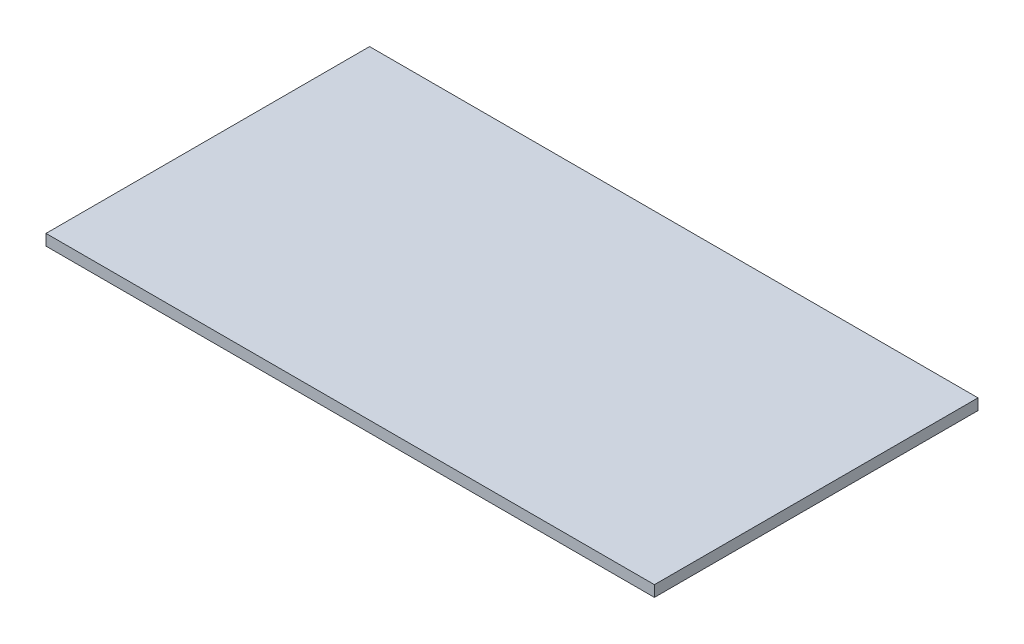
ISO-10303-21;
HEADER;
FILE_DESCRIPTION(('STEP AP214'),'2;1');
FILE_NAME('part.step','',(''),(''),'','','');
FILE_SCHEMA(('AUTOMOTIVE_DESIGN { 1 0 10303 214 1 1 1 1 }'));
ENDSEC;
DATA;
#1=APPLICATION_CONTEXT('core data for automotive mechanical design processes');
#2=APPLICATION_PROTOCOL_DEFINITION('international standard','automotive_design',2000,#1);
#3=PRODUCT_CONTEXT('',#1,'mechanical');
#4=PRODUCT('Part','Part','',(#3));
#5=PRODUCT_RELATED_PRODUCT_CATEGORY('part','',(#4));
#6=PRODUCT_DEFINITION_FORMATION('','',#4);
#7=PRODUCT_DEFINITION_CONTEXT('part definition',#1,'design');
#8=PRODUCT_DEFINITION('design','',#6,#7);
#9=PRODUCT_DEFINITION_SHAPE('','',#8);
#10=(LENGTH_UNIT() NAMED_UNIT(*) SI_UNIT(.MILLI.,.METRE.));
#11=(NAMED_UNIT(*) PLANE_ANGLE_UNIT() SI_UNIT($,.RADIAN.));
#12=(NAMED_UNIT(*) SI_UNIT($,.STERADIAN.) SOLID_ANGLE_UNIT());
#13=UNCERTAINTY_MEASURE_WITH_UNIT(LENGTH_MEASURE(1.E-05),#10,'distance_accuracy_value','');
#14=(GEOMETRIC_REPRESENTATION_CONTEXT(3) GLOBAL_UNCERTAINTY_ASSIGNED_CONTEXT((#13)) GLOBAL_UNIT_ASSIGNED_CONTEXT((#10,
#11,#12)) REPRESENTATION_CONTEXT('',''));
#15=CARTESIAN_POINT('',(0.,0.,0.));
#16=DIRECTION('',(0.,0.,1.));
#17=DIRECTION('',(1.,0.,0.));
#18=AXIS2_PLACEMENT_3D('',#15,#16,#17);
#19=CARTESIAN_POINT('',(110.,4.,58.5));
#20=DIRECTION('',(-1.,0.,0.));
#21=DIRECTION('',(0.,0.,1.));
#22=AXIS2_PLACEMENT_3D('',#19,#20,#21);
#23=PLANE('',#22);
#24=DIRECTION('',(0.,0.,-1.));
#25=VECTOR('',#24,1.);
#26=CARTESIAN_POINT('',(110.,0.,58.5));
#27=LINE('',#26,#25);
#28=CARTESIAN_POINT('',(110.,0.,58.5));
#29=VERTEX_POINT('',#28);
#30=CARTESIAN_POINT('',(110.,0.,-58.5));
#31=VERTEX_POINT('',#30);
#32=EDGE_CURVE('E112',#29,#31,#27,.T.);
#33=ORIENTED_EDGE('',*,*,#32,.T.);
#34=DIRECTION('',(0.,-1.,0.));
#35=VECTOR('',#34,1.);
#36=CARTESIAN_POINT('',(110.,4.,-58.5));
#37=LINE('',#36,#35);
#38=CARTESIAN_POINT('',(110.,4.,-58.5));
#39=VERTEX_POINT('',#38);
#40=EDGE_CURVE('E11',#39,#31,#37,.T.);
#41=ORIENTED_EDGE('',*,*,#40,.F.);
#42=DIRECTION('',(0.,0.,-1.));
#43=VECTOR('',#42,1.);
#44=CARTESIAN_POINT('',(110.,4.,58.5));
#45=LINE('',#44,#43);
#46=CARTESIAN_POINT('',(110.,4.,58.5));
#47=VERTEX_POINT('',#46);
#48=EDGE_CURVE('E96',#47,#39,#45,.T.);
#49=ORIENTED_EDGE('',*,*,#48,.F.);
#50=DIRECTION('',(0.,-1.,0.));
#51=VECTOR('',#50,1.);
#52=CARTESIAN_POINT('',(110.,4.,58.5));
#53=LINE('',#52,#51);
#54=EDGE_CURVE('E108',#47,#29,#53,.T.);
#55=ORIENTED_EDGE('',*,*,#54,.T.);
#56=EDGE_LOOP('',(#33,#41,#49,#55));
#57=FACE_BOUND('',#56,.T.);
#58=ADVANCED_FACE('F44',(#57),#23,.F.);
#59=CARTESIAN_POINT('',(-110.,4.,-58.5));
#60=DIRECTION('',(0.,0.,1.));
#61=DIRECTION('',(1.,0.,0.));
#62=AXIS2_PLACEMENT_3D('',#59,#60,#61);
#63=PLANE('',#62);
#64=DIRECTION('',(-1.,0.,0.));
#65=VECTOR('',#64,1.);
#66=CARTESIAN_POINT('',(-110.,0.,-58.5));
#67=LINE('',#66,#65);
#68=CARTESIAN_POINT('',(-110.,0.,-58.5));
#69=VERTEX_POINT('',#68);
#70=EDGE_CURVE('E101',#31,#69,#67,.T.);
#71=ORIENTED_EDGE('',*,*,#70,.T.);
#72=DIRECTION('',(0.,-1.,0.));
#73=VECTOR('',#72,1.);
#74=CARTESIAN_POINT('',(-110.,4.,-58.5));
#75=LINE('',#74,#73);
#76=CARTESIAN_POINT('',(-110.,4.,-58.5));
#77=VERTEX_POINT('',#76);
#78=EDGE_CURVE('E53',#77,#69,#75,.T.);
#79=ORIENTED_EDGE('',*,*,#78,.F.);
#80=DIRECTION('',(-1.,0.,0.));
#81=VECTOR('',#80,1.);
#82=CARTESIAN_POINT('',(-110.,4.,-58.5));
#83=LINE('',#82,#81);
#84=EDGE_CURVE('E91',#39,#77,#83,.T.);
#85=ORIENTED_EDGE('',*,*,#84,.F.);
#86=ORIENTED_EDGE('',*,*,#40,.T.);
#87=EDGE_LOOP('',(#71,#79,#85,#86));
#88=FACE_BOUND('',#87,.T.);
#89=ADVANCED_FACE('F100',(#88),#63,.F.);
#90=CARTESIAN_POINT('',(-110.,4.,58.5));
#91=DIRECTION('',(1.,0.,0.));
#92=DIRECTION('',(0.,0.,-1.));
#93=AXIS2_PLACEMENT_3D('',#90,#91,#92);
#94=PLANE('',#93);
#95=DIRECTION('',(0.,0.,1.));
#96=VECTOR('',#95,1.);
#97=CARTESIAN_POINT('',(-110.,0.,58.5));
#98=LINE('',#97,#96);
#99=CARTESIAN_POINT('',(-110.,0.,58.5));
#100=VERTEX_POINT('',#99);
#101=EDGE_CURVE('E78',#69,#100,#98,.T.);
#102=ORIENTED_EDGE('',*,*,#101,.T.);
#103=DIRECTION('',(0.,-1.,0.));
#104=VECTOR('',#103,1.);
#105=CARTESIAN_POINT('',(-110.,4.,58.5));
#106=LINE('',#105,#104);
#107=CARTESIAN_POINT('',(-110.,4.,58.5));
#108=VERTEX_POINT('',#107);
#109=EDGE_CURVE('E103',#108,#100,#106,.T.);
#110=ORIENTED_EDGE('',*,*,#109,.F.);
#111=DIRECTION('',(0.,0.,1.));
#112=VECTOR('',#111,1.);
#113=CARTESIAN_POINT('',(-110.,4.,58.5));
#114=LINE('',#113,#112);
#115=EDGE_CURVE('E94',#77,#108,#114,.T.);
#116=ORIENTED_EDGE('',*,*,#115,.F.);
#117=ORIENTED_EDGE('',*,*,#78,.T.);
#118=EDGE_LOOP('',(#102,#110,#116,#117));
#119=FACE_BOUND('',#118,.T.);
#120=ADVANCED_FACE('F104',(#119),#94,.F.);
#121=CARTESIAN_POINT('',(-110.,4.,58.5));
#122=DIRECTION('',(0.,0.,-1.));
#123=DIRECTION('',(-1.,0.,0.));
#124=AXIS2_PLACEMENT_3D('',#121,#122,#123);
#125=PLANE('',#124);
#126=DIRECTION('',(1.,0.,0.));
#127=VECTOR('',#126,1.);
#128=CARTESIAN_POINT('',(-110.,0.,58.5));
#129=LINE('',#128,#127);
#130=EDGE_CURVE('E84',#100,#29,#129,.T.);
#131=ORIENTED_EDGE('',*,*,#130,.T.);
#132=ORIENTED_EDGE('',*,*,#54,.F.);
#133=DIRECTION('',(1.,0.,0.));
#134=VECTOR('',#133,1.);
#135=CARTESIAN_POINT('',(-110.,4.,58.5));
#136=LINE('',#135,#134);
#137=EDGE_CURVE('E61',#108,#47,#136,.T.);
#138=ORIENTED_EDGE('',*,*,#137,.F.);
#139=ORIENTED_EDGE('',*,*,#109,.T.);
#140=EDGE_LOOP('',(#131,#132,#138,#139));
#141=FACE_BOUND('',#140,.T.);
#142=ADVANCED_FACE('F125',(#141),#125,.F.);
#143=CARTESIAN_POINT('',(0.,4.,0.));
#144=DIRECTION('',(0.,-1.,0.));
#145=DIRECTION('',(0.,0.,-1.));
#146=AXIS2_PLACEMENT_3D('',#143,#144,#145);
#147=PLANE('',#146);
#148=ORIENTED_EDGE('',*,*,#48,.T.);
#149=ORIENTED_EDGE('',*,*,#84,.T.);
#150=ORIENTED_EDGE('',*,*,#115,.T.);
#151=ORIENTED_EDGE('',*,*,#137,.T.);
#152=EDGE_LOOP('',(#148,#149,#150,#151));
#153=FACE_BOUND('',#152,.T.);
#154=ADVANCED_FACE('F92',(#153),#147,.F.);
#155=CARTESIAN_POINT('',(0.,0.,0.));
#156=DIRECTION('',(0.,-1.,0.));
#157=DIRECTION('',(0.,0.,-1.));
#158=AXIS2_PLACEMENT_3D('',#155,#156,#157);
#159=PLANE('',#158);
#160=ORIENTED_EDGE('',*,*,#32,.F.);
#161=ORIENTED_EDGE('',*,*,#130,.F.);
#162=ORIENTED_EDGE('',*,*,#101,.F.);
#163=ORIENTED_EDGE('',*,*,#70,.F.);
#164=EDGE_LOOP('',(#160,#161,#162,#163));
#165=FACE_BOUND('',#164,.T.);
#166=ADVANCED_FACE('F128',(#165),#159,.T.);
#167=CLOSED_SHELL('',(#58,#89,#120,#142,#154,#166));
#168=MANIFOLD_SOLID_BREP('B2',#167);
#169=ADVANCED_BREP_SHAPE_REPRESENTATION('',(#18,#168),#14);
#170=SHAPE_DEFINITION_REPRESENTATION(#9,#169);
ENDSEC;
END-ISO-10303-21;
